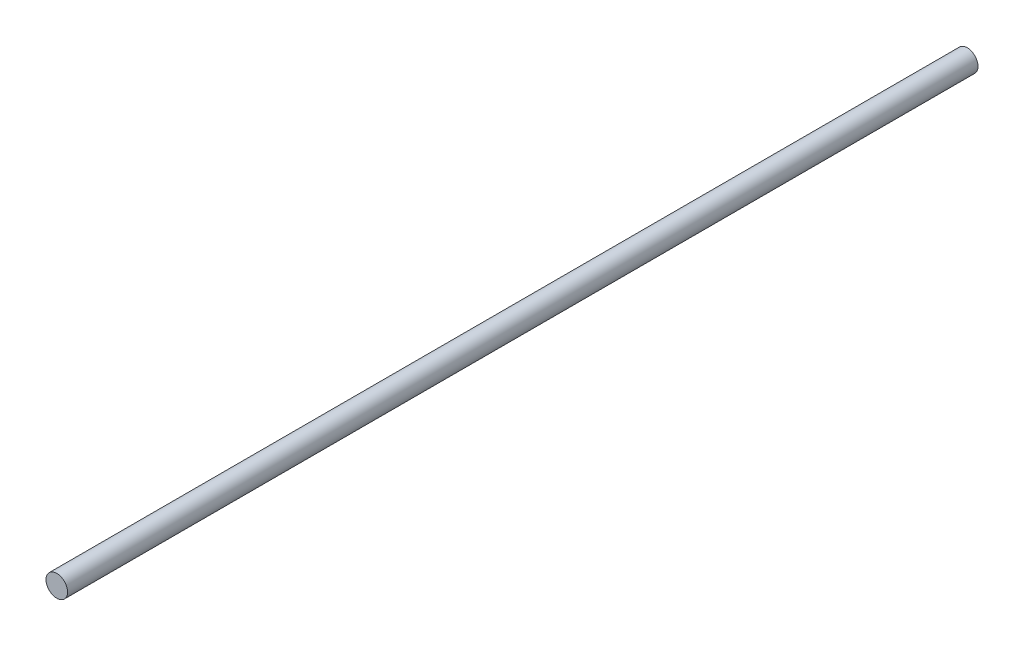
ISO-10303-21;
HEADER;
FILE_DESCRIPTION(('STEP AP214'),'2;1');
FILE_NAME('part.step','',(''),(''),'','','');
FILE_SCHEMA(('AUTOMOTIVE_DESIGN { 1 0 10303 214 1 1 1 1 }'));
ENDSEC;
DATA;
#1=APPLICATION_CONTEXT('core data for automotive mechanical design processes');
#2=APPLICATION_PROTOCOL_DEFINITION('international standard','automotive_design',2000,#1);
#3=PRODUCT_CONTEXT('',#1,'mechanical');
#4=PRODUCT('Part','Part','',(#3));
#5=PRODUCT_RELATED_PRODUCT_CATEGORY('part','',(#4));
#6=PRODUCT_DEFINITION_FORMATION('','',#4);
#7=PRODUCT_DEFINITION_CONTEXT('part definition',#1,'design');
#8=PRODUCT_DEFINITION('design','',#6,#7);
#9=PRODUCT_DEFINITION_SHAPE('','',#8);
#10=(LENGTH_UNIT() NAMED_UNIT(*) SI_UNIT(.MILLI.,.METRE.));
#11=(NAMED_UNIT(*) PLANE_ANGLE_UNIT() SI_UNIT($,.RADIAN.));
#12=(NAMED_UNIT(*) SI_UNIT($,.STERADIAN.) SOLID_ANGLE_UNIT());
#13=UNCERTAINTY_MEASURE_WITH_UNIT(LENGTH_MEASURE(1.E-05),#10,'distance_accuracy_value','');
#14=(GEOMETRIC_REPRESENTATION_CONTEXT(3) GLOBAL_UNCERTAINTY_ASSIGNED_CONTEXT((#13)) GLOBAL_UNIT_ASSIGNED_CONTEXT((#10,
#11,#12)) REPRESENTATION_CONTEXT('',''));
#15=CARTESIAN_POINT('',(0.,0.,0.));
#16=DIRECTION('',(0.,0.,1.));
#17=DIRECTION('',(1.,0.,0.));
#18=AXIS2_PLACEMENT_3D('',#15,#16,#17);
#19=CARTESIAN_POINT('',(0.,0.,268.));
#20=DIRECTION('',(0.,0.,-1.));
#21=DIRECTION('',(-1.,0.,0.));
#22=AXIS2_PLACEMENT_3D('',#19,#20,#21);
#23=CYLINDRICAL_SURFACE('',#22,6.35);
#24=CARTESIAN_POINT('',(0.,0.,268.));
#25=DIRECTION('',(0.,0.,1.));
#26=DIRECTION('',(1.,0.,0.));
#27=AXIS2_PLACEMENT_3D('',#24,#25,#26);
#28=CIRCLE('',#27,6.35);
#29=CARTESIAN_POINT('',(6.35,0.,268.));
#30=VERTEX_POINT('',#29);
#31=EDGE_CURVE('E10',#30,#30,#28,.T.);
#32=ORIENTED_EDGE('',*,*,#31,.F.);
#33=EDGE_LOOP('',(#32));
#34=FACE_BOUND('',#33,.T.);
#35=CARTESIAN_POINT('',(0.,0.,-268.));
#36=DIRECTION('',(0.,0.,1.));
#37=DIRECTION('',(1.,0.,0.));
#38=AXIS2_PLACEMENT_3D('',#35,#36,#37);
#39=CIRCLE('',#38,6.35);
#40=CARTESIAN_POINT('',(6.35,0.,-268.));
#41=VERTEX_POINT('',#40);
#42=EDGE_CURVE('E50',#41,#41,#39,.T.);
#43=ORIENTED_EDGE('',*,*,#42,.T.);
#44=EDGE_LOOP('',(#43));
#45=FACE_BOUND('',#44,.T.);
#46=ADVANCED_FACE('F47',(#34,#45),#23,.T.);
#47=CARTESIAN_POINT('',(0.,0.,268.));
#48=DIRECTION('',(0.,0.,1.));
#49=DIRECTION('',(1.,0.,0.));
#50=AXIS2_PLACEMENT_3D('',#47,#48,#49);
#51=PLANE('',#50);
#52=ORIENTED_EDGE('',*,*,#31,.T.);
#53=EDGE_LOOP('',(#52));
#54=FACE_BOUND('',#53,.T.);
#55=ADVANCED_FACE('F64',(#54),#51,.T.);
#56=CARTESIAN_POINT('',(0.,0.,-268.));
#57=DIRECTION('',(0.,0.,1.));
#58=DIRECTION('',(1.,0.,0.));
#59=AXIS2_PLACEMENT_3D('',#56,#57,#58);
#60=PLANE('',#59);
#61=ORIENTED_EDGE('',*,*,#42,.F.);
#62=EDGE_LOOP('',(#61));
#63=FACE_BOUND('',#62,.T.);
#64=ADVANCED_FACE('F62',(#63),#60,.F.);
#65=CLOSED_SHELL('',(#46,#55,#64));
#66=MANIFOLD_SOLID_BREP('B2',#65);
#67=ADVANCED_BREP_SHAPE_REPRESENTATION('',(#18,#66),#14);
#68=SHAPE_DEFINITION_REPRESENTATION(#9,#67);
ENDSEC;
END-ISO-10303-21;
